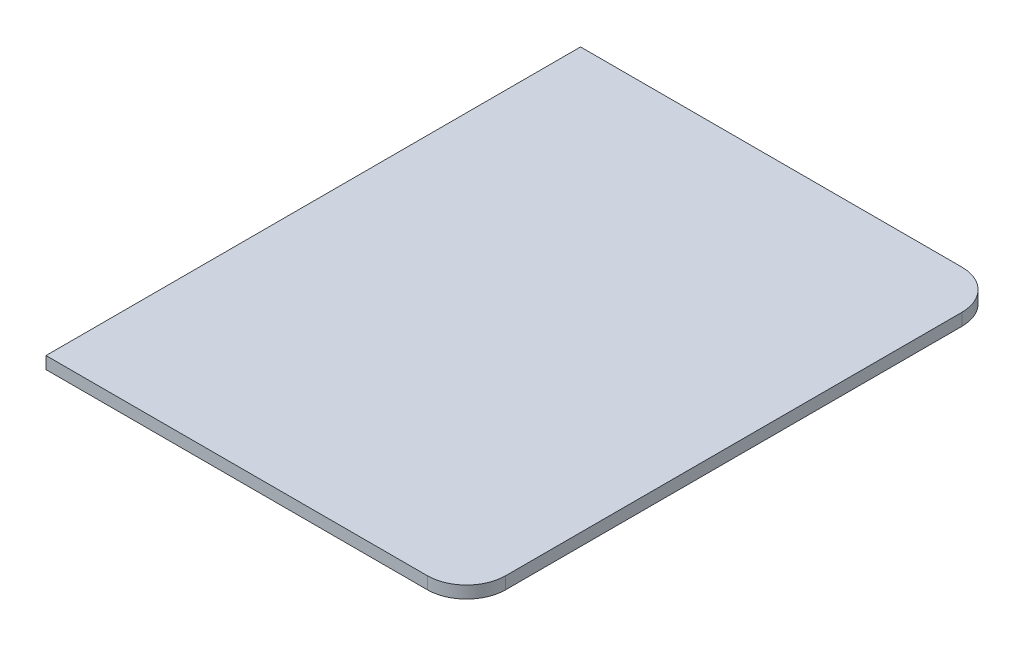
ISO-10303-21;
HEADER;
FILE_DESCRIPTION(('STEP AP214'),'2;1');
FILE_NAME('part.step','',(''),(''),'','','');
FILE_SCHEMA(('AUTOMOTIVE_DESIGN { 1 0 10303 214 1 1 1 1 }'));
ENDSEC;
DATA;
#1=APPLICATION_CONTEXT('core data for automotive mechanical design processes');
#2=APPLICATION_PROTOCOL_DEFINITION('international standard','automotive_design',2000,#1);
#3=PRODUCT_CONTEXT('',#1,'mechanical');
#4=PRODUCT('Part','Part','',(#3));
#5=PRODUCT_RELATED_PRODUCT_CATEGORY('part','',(#4));
#6=PRODUCT_DEFINITION_FORMATION('','',#4);
#7=PRODUCT_DEFINITION_CONTEXT('part definition',#1,'design');
#8=PRODUCT_DEFINITION('design','',#6,#7);
#9=PRODUCT_DEFINITION_SHAPE('','',#8);
#10=(LENGTH_UNIT() NAMED_UNIT(*) SI_UNIT(.MILLI.,.METRE.));
#11=(NAMED_UNIT(*) PLANE_ANGLE_UNIT() SI_UNIT($,.RADIAN.));
#12=(NAMED_UNIT(*) SI_UNIT($,.STERADIAN.) SOLID_ANGLE_UNIT());
#13=UNCERTAINTY_MEASURE_WITH_UNIT(LENGTH_MEASURE(1.E-05),#10,'distance_accuracy_value','');
#14=(GEOMETRIC_REPRESENTATION_CONTEXT(3) GLOBAL_UNCERTAINTY_ASSIGNED_CONTEXT((#13)) GLOBAL_UNIT_ASSIGNED_CONTEXT((#10,
#11,#12)) REPRESENTATION_CONTEXT('',''));
#15=CARTESIAN_POINT('',(0.,0.,0.));
#16=DIRECTION('',(0.,0.,1.));
#17=DIRECTION('',(1.,0.,0.));
#18=AXIS2_PLACEMENT_3D('',#15,#16,#17);
#19=CARTESIAN_POINT('',(-103.487400661469,99.20415570185,-328.791357833779));
#20=DIRECTION('',(-1.,0.,0.));
#21=DIRECTION('',(0.,0.,1.));
#22=AXIS2_PLACEMENT_3D('',#19,#20,#21);
#23=PLANE('',#22);
#24=DIRECTION('',(0.,0.,-1.));
#25=VECTOR('',#24,1.);
#26=CARTESIAN_POINT('',(-103.487400661469,97.7063535413109,-328.791357833779));
#27=LINE('',#26,#25);
#28=CARTESIAN_POINT('',(-103.487400661469,97.7063535413109,-328.791357833779));
#29=VERTEX_POINT('',#28);
#30=CARTESIAN_POINT('',(-103.487400661469,97.7063535413109,-394.415673074119));
#31=VERTEX_POINT('',#30);
#32=EDGE_CURVE('E100',#29,#31,#27,.T.);
#33=ORIENTED_EDGE('',*,*,#32,.F.);
#34=DIRECTION('',(0.,-1.,0.));
#35=VECTOR('',#34,1.);
#36=CARTESIAN_POINT('',(-103.487400661469,99.20415570185,-328.791357833779));
#37=LINE('',#36,#35);
#38=CARTESIAN_POINT('',(-103.487400661469,99.20415570185,-328.791357833779));
#39=VERTEX_POINT('',#38);
#40=EDGE_CURVE('E32',#39,#29,#37,.T.);
#41=ORIENTED_EDGE('',*,*,#40,.F.);
#42=DIRECTION('',(0.,0.,-1.));
#43=VECTOR('',#42,1.);
#44=CARTESIAN_POINT('',(-103.487400661469,99.20415570185,-328.791357833779));
#45=LINE('',#44,#43);
#46=CARTESIAN_POINT('',(-103.487400661469,99.20415570185,-394.415673074119));
#47=VERTEX_POINT('',#46);
#48=EDGE_CURVE('E114',#39,#47,#45,.T.);
#49=ORIENTED_EDGE('',*,*,#48,.T.);
#50=DIRECTION('',(0.,-1.,0.));
#51=VECTOR('',#50,1.);
#52=CARTESIAN_POINT('',(-103.487400661469,99.20415570185,-394.415673074119));
#53=LINE('',#52,#51);
#54=EDGE_CURVE('E10',#47,#31,#53,.T.);
#55=ORIENTED_EDGE('',*,*,#54,.T.);
#56=EDGE_LOOP('',(#33,#41,#49,#55));
#57=FACE_BOUND('',#56,.T.);
#58=ADVANCED_FACE('F16',(#57),#23,.T.);
#59=CARTESIAN_POINT('',(-103.487400661469,99.20415570185,-394.415673074119));
#60=DIRECTION('',(0.,0.,-1.));
#61=DIRECTION('',(-1.,0.,0.));
#62=AXIS2_PLACEMENT_3D('',#59,#60,#61);
#63=PLANE('',#62);
#64=DIRECTION('',(1.,0.,0.));
#65=VECTOR('',#64,1.);
#66=CARTESIAN_POINT('',(-103.487400661469,97.7063535413109,-394.415673074119));
#67=LINE('',#66,#65);
#68=CARTESIAN_POINT('',(-56.6752430412992,97.7063535413109,-394.415673074119));
#69=VERTEX_POINT('',#68);
#70=EDGE_CURVE('E103',#31,#69,#67,.T.);
#71=ORIENTED_EDGE('',*,*,#70,.F.);
#72=ORIENTED_EDGE('',*,*,#54,.F.);
#73=DIRECTION('',(1.,0.,0.));
#74=VECTOR('',#73,1.);
#75=CARTESIAN_POINT('',(-103.487400661469,99.20415570185,-394.415673074119));
#76=LINE('',#75,#74);
#77=CARTESIAN_POINT('',(-56.6752430412992,99.20415570185,-394.415673074119));
#78=VERTEX_POINT('',#77);
#79=EDGE_CURVE('E119',#47,#78,#76,.T.);
#80=ORIENTED_EDGE('',*,*,#79,.T.);
#81=DIRECTION('',(0.,-1.,0.));
#82=VECTOR('',#81,1.);
#83=CARTESIAN_POINT('',(-56.6752430412992,99.20415570185,-394.415673074119));
#84=LINE('',#83,#82);
#85=EDGE_CURVE('E24',#78,#69,#84,.T.);
#86=ORIENTED_EDGE('',*,*,#85,.T.);
#87=EDGE_LOOP('',(#71,#72,#80,#86));
#88=FACE_BOUND('',#87,.T.);
#89=ADVANCED_FACE('F118',(#88),#63,.T.);
#90=CARTESIAN_POINT('',(-56.6752430412992,99.20415570185,-389.603515453949));
#91=DIRECTION('',(0.,-1.,0.));
#92=DIRECTION('',(0.,0.,-1.));
#93=AXIS2_PLACEMENT_3D('',#90,#91,#92);
#94=CYLINDRICAL_SURFACE('',#93,4.8121576201699);
#95=CARTESIAN_POINT('',(-56.6752430412992,97.7063535413109,-389.603515453949));
#96=DIRECTION('',(0.,-1.,0.));
#97=DIRECTION('',(0.,0.,-1.));
#98=AXIS2_PLACEMENT_3D('',#95,#96,#97);
#99=CIRCLE('',#98,4.8121576201699);
#100=CARTESIAN_POINT('',(-51.8630854211293,97.7063535413109,-389.603515453949));
#101=VERTEX_POINT('',#100);
#102=EDGE_CURVE('E106',#69,#101,#99,.T.);
#103=ORIENTED_EDGE('',*,*,#102,.F.);
#104=ORIENTED_EDGE('',*,*,#85,.F.);
#105=CARTESIAN_POINT('',(-56.6752430412992,99.20415570185,-389.603515453949));
#106=DIRECTION('',(0.,-1.,0.));
#107=DIRECTION('',(0.,0.,-1.));
#108=AXIS2_PLACEMENT_3D('',#105,#106,#107);
#109=CIRCLE('',#108,4.8121576201699);
#110=CARTESIAN_POINT('',(-51.8630854211293,99.20415570185,-389.603515453949));
#111=VERTEX_POINT('',#110);
#112=EDGE_CURVE('E91',#78,#111,#109,.T.);
#113=ORIENTED_EDGE('',*,*,#112,.T.);
#114=DIRECTION('',(0.,-1.,0.));
#115=VECTOR('',#114,1.);
#116=CARTESIAN_POINT('',(-51.8630854211293,99.20415570185,-389.603515453949));
#117=LINE('',#116,#115);
#118=EDGE_CURVE('E83',#111,#101,#117,.T.);
#119=ORIENTED_EDGE('',*,*,#118,.T.);
#120=EDGE_LOOP('',(#103,#104,#113,#119));
#121=FACE_BOUND('',#120,.T.);
#122=ADVANCED_FACE('F121',(#121),#94,.T.);
#123=CARTESIAN_POINT('',(-51.8630854211293,99.20415570185,-389.603515453949));
#124=DIRECTION('',(1.,0.,0.));
#125=DIRECTION('',(0.,0.,-1.));
#126=AXIS2_PLACEMENT_3D('',#123,#124,#125);
#127=PLANE('',#126);
#128=DIRECTION('',(0.,0.,1.));
#129=VECTOR('',#128,1.);
#130=CARTESIAN_POINT('',(-51.8630854211293,97.7063535413109,-389.603515453949));
#131=LINE('',#130,#129);
#132=CARTESIAN_POINT('',(-51.8630854211294,97.7063535413109,-333.603515453949));
#133=VERTEX_POINT('',#132);
#134=EDGE_CURVE('E109',#101,#133,#131,.T.);
#135=ORIENTED_EDGE('',*,*,#134,.F.);
#136=ORIENTED_EDGE('',*,*,#118,.F.);
#137=DIRECTION('',(0.,0.,1.));
#138=VECTOR('',#137,1.);
#139=CARTESIAN_POINT('',(-51.8630854211293,99.20415570185,-389.603515453949));
#140=LINE('',#139,#138);
#141=CARTESIAN_POINT('',(-51.8630854211294,99.20415570185,-333.603515453949));
#142=VERTEX_POINT('',#141);
#143=EDGE_CURVE('E86',#111,#142,#140,.T.);
#144=ORIENTED_EDGE('',*,*,#143,.T.);
#145=DIRECTION('',(0.,-1.,0.));
#146=VECTOR('',#145,1.);
#147=CARTESIAN_POINT('',(-51.8630854211294,99.20415570185,-333.603515453949));
#148=LINE('',#147,#146);
#149=EDGE_CURVE('E72',#142,#133,#148,.T.);
#150=ORIENTED_EDGE('',*,*,#149,.T.);
#151=EDGE_LOOP('',(#135,#136,#144,#150));
#152=FACE_BOUND('',#151,.T.);
#153=ADVANCED_FACE('F87',(#152),#127,.T.);
#154=CARTESIAN_POINT('',(-56.6752430412993,99.20415570185,-333.603515453949));
#155=DIRECTION('',(0.,-1.,0.));
#156=DIRECTION('',(0.,0.,-1.));
#157=AXIS2_PLACEMENT_3D('',#154,#155,#156);
#158=CYLINDRICAL_SURFACE('',#157,4.81215762016989);
#159=CARTESIAN_POINT('',(-56.6752430412993,97.7063535413109,-333.603515453949));
#160=DIRECTION('',(0.,-1.,0.));
#161=DIRECTION('',(1.,0.,0.));
#162=AXIS2_PLACEMENT_3D('',#159,#160,#161);
#163=CIRCLE('',#162,4.81215762016989);
#164=CARTESIAN_POINT('',(-56.6752430412993,97.7063535413109,-328.791357833779));
#165=VERTEX_POINT('',#164);
#166=EDGE_CURVE('E79',#133,#165,#163,.T.);
#167=ORIENTED_EDGE('',*,*,#166,.F.);
#168=ORIENTED_EDGE('',*,*,#149,.F.);
#169=CARTESIAN_POINT('',(-56.6752430412993,99.20415570185,-333.603515453949));
#170=DIRECTION('',(0.,-1.,0.));
#171=DIRECTION('',(1.,0.,0.));
#172=AXIS2_PLACEMENT_3D('',#169,#170,#171);
#173=CIRCLE('',#172,4.81215762016989);
#174=CARTESIAN_POINT('',(-56.6752430412993,99.20415570185,-328.791357833779));
#175=VERTEX_POINT('',#174);
#176=EDGE_CURVE('E76',#142,#175,#173,.T.);
#177=ORIENTED_EDGE('',*,*,#176,.T.);
#178=DIRECTION('',(0.,-1.,0.));
#179=VECTOR('',#178,1.);
#180=CARTESIAN_POINT('',(-56.6752430412993,99.20415570185,-328.791357833779));
#181=LINE('',#180,#179);
#182=EDGE_CURVE('E54',#175,#165,#181,.T.);
#183=ORIENTED_EDGE('',*,*,#182,.T.);
#184=EDGE_LOOP('',(#167,#168,#177,#183));
#185=FACE_BOUND('',#184,.T.);
#186=ADVANCED_FACE('F74',(#185),#158,.T.);
#187=CARTESIAN_POINT('',(-56.6752430412993,99.20415570185,-328.791357833779));
#188=DIRECTION('',(0.,0.,1.));
#189=DIRECTION('',(1.,0.,0.));
#190=AXIS2_PLACEMENT_3D('',#187,#188,#189);
#191=PLANE('',#190);
#192=DIRECTION('',(-1.,0.,0.));
#193=VECTOR('',#192,1.);
#194=CARTESIAN_POINT('',(-56.6752430412993,97.7063535413109,-328.791357833779));
#195=LINE('',#194,#193);
#196=EDGE_CURVE('E112',#165,#29,#195,.T.);
#197=ORIENTED_EDGE('',*,*,#196,.F.);
#198=ORIENTED_EDGE('',*,*,#182,.F.);
#199=DIRECTION('',(-1.,0.,0.));
#200=VECTOR('',#199,1.);
#201=CARTESIAN_POINT('',(-56.6752430412993,99.20415570185,-328.791357833779));
#202=LINE('',#201,#200);
#203=EDGE_CURVE('E95',#175,#39,#202,.T.);
#204=ORIENTED_EDGE('',*,*,#203,.T.);
#205=ORIENTED_EDGE('',*,*,#40,.T.);
#206=EDGE_LOOP('',(#197,#198,#204,#205));
#207=FACE_BOUND('',#206,.T.);
#208=ADVANCED_FACE('F140',(#207),#191,.T.);
#209=CARTESIAN_POINT('',(-104.175243041299,99.20415570185,-361.603515453949));
#210=DIRECTION('',(0.,-1.,0.));
#211=DIRECTION('',(1.,0.,0.));
#212=AXIS2_PLACEMENT_3D('',#209,#210,#211);
#213=PLANE('',#212);
#214=ORIENTED_EDGE('',*,*,#48,.F.);
#215=ORIENTED_EDGE('',*,*,#203,.F.);
#216=ORIENTED_EDGE('',*,*,#176,.F.);
#217=ORIENTED_EDGE('',*,*,#143,.F.);
#218=ORIENTED_EDGE('',*,*,#112,.F.);
#219=ORIENTED_EDGE('',*,*,#79,.F.);
#220=EDGE_LOOP('',(#214,#215,#216,#217,#218,#219));
#221=FACE_BOUND('',#220,.T.);
#222=ADVANCED_FACE('F94',(#221),#213,.F.);
#223=CARTESIAN_POINT('',(-104.175243041299,97.7063535413109,-361.603515453949));
#224=DIRECTION('',(0.,-1.,0.));
#225=DIRECTION('',(1.,0.,0.));
#226=AXIS2_PLACEMENT_3D('',#223,#224,#225);
#227=PLANE('',#226);
#228=ORIENTED_EDGE('',*,*,#32,.T.);
#229=ORIENTED_EDGE('',*,*,#70,.T.);
#230=ORIENTED_EDGE('',*,*,#102,.T.);
#231=ORIENTED_EDGE('',*,*,#134,.T.);
#232=ORIENTED_EDGE('',*,*,#166,.T.);
#233=ORIENTED_EDGE('',*,*,#196,.T.);
#234=EDGE_LOOP('',(#228,#229,#230,#231,#232,#233));
#235=FACE_BOUND('',#234,.T.);
#236=ADVANCED_FACE('F123',(#235),#227,.T.);
#237=CLOSED_SHELL('',(#58,#89,#122,#153,#186,#208,#222,#236));
#238=MANIFOLD_SOLID_BREP('B1',#237);
#239=ADVANCED_BREP_SHAPE_REPRESENTATION('',(#18,#238),#14);
#240=SHAPE_DEFINITION_REPRESENTATION(#9,#239);
ENDSEC;
END-ISO-10303-21;
